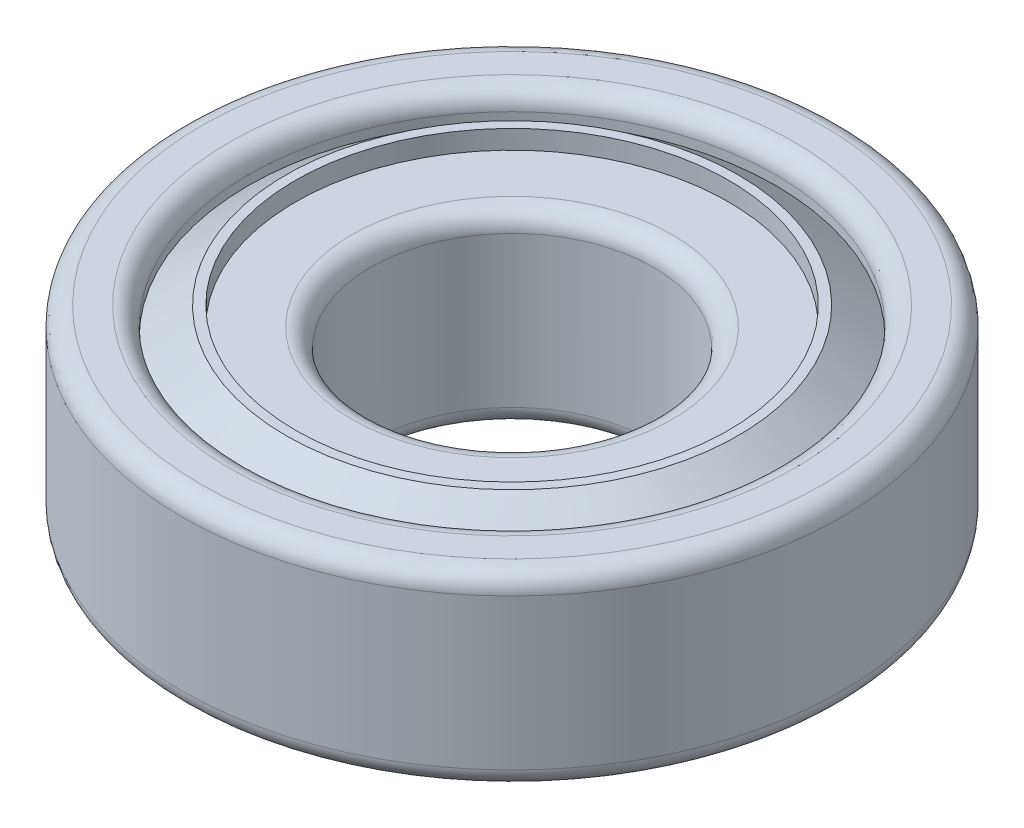
ISO-10303-21;
HEADER;
FILE_DESCRIPTION(('STEP AP214'),'2;1');
FILE_NAME('part.step','',(''),(''),'','','');
FILE_SCHEMA(('AUTOMOTIVE_DESIGN { 1 0 10303 214 1 1 1 1 }'));
ENDSEC;
DATA;
#1=APPLICATION_CONTEXT('core data for automotive mechanical design processes');
#2=APPLICATION_PROTOCOL_DEFINITION('international standard','automotive_design',2000,#1);
#3=PRODUCT_CONTEXT('',#1,'mechanical');
#4=PRODUCT('Part','Part','',(#3));
#5=PRODUCT_RELATED_PRODUCT_CATEGORY('part','',(#4));
#6=PRODUCT_DEFINITION_FORMATION('','',#4);
#7=PRODUCT_DEFINITION_CONTEXT('part definition',#1,'design');
#8=PRODUCT_DEFINITION('design','',#6,#7);
#9=PRODUCT_DEFINITION_SHAPE('','',#8);
#10=(LENGTH_UNIT() NAMED_UNIT(*) SI_UNIT(.MILLI.,.METRE.));
#11=(NAMED_UNIT(*) PLANE_ANGLE_UNIT() SI_UNIT($,.RADIAN.));
#12=(NAMED_UNIT(*) SI_UNIT($,.STERADIAN.) SOLID_ANGLE_UNIT());
#13=UNCERTAINTY_MEASURE_WITH_UNIT(LENGTH_MEASURE(1.E-05),#10,'distance_accuracy_value','');
#14=(GEOMETRIC_REPRESENTATION_CONTEXT(3) GLOBAL_UNCERTAINTY_ASSIGNED_CONTEXT((#13)) GLOBAL_UNIT_ASSIGNED_CONTEXT((#10,
#11,#12)) REPRESENTATION_CONTEXT('',''));
#15=CARTESIAN_POINT('',(0.,0.,0.));
#16=DIRECTION('',(0.,0.,1.));
#17=DIRECTION('',(1.,0.,0.));
#18=AXIS2_PLACEMENT_3D('',#15,#16,#17);
#19=CARTESIAN_POINT('',(0.,9.,0.));
#20=DIRECTION('',(0.,-1.,0.));
#21=DIRECTION('',(0.,0.,-1.));
#22=AXIS2_PLACEMENT_3D('',#19,#20,#21);
#23=PLANE('',#22);
#24=CARTESIAN_POINT('',(0.,9.,0.));
#25=DIRECTION('',(0.,-1.,0.));
#26=DIRECTION('',(0.,0.,-1.));
#27=AXIS2_PLACEMENT_3D('',#24,#25,#26);
#28=CIRCLE('',#27,8.5);
#29=CARTESIAN_POINT('',(0.,9.,-8.5));
#30=VERTEX_POINT('',#29);
#31=EDGE_CURVE('E10',#30,#30,#28,.T.);
#32=ORIENTED_EDGE('',*,*,#31,.T.);
#33=EDGE_LOOP('',(#32));
#34=FACE_BOUND('',#33,.T.);
#35=CARTESIAN_POINT('',(0.,9.,0.));
#36=DIRECTION('',(0.,1.,0.));
#37=DIRECTION('',(0.,0.,1.));
#38=AXIS2_PLACEMENT_3D('',#35,#36,#37);
#39=CIRCLE('',#38,11.5);
#40=CARTESIAN_POINT('',(0.,9.,11.5));
#41=VERTEX_POINT('',#40);
#42=EDGE_CURVE('E86',#41,#41,#39,.T.);
#43=ORIENTED_EDGE('',*,*,#42,.T.);
#44=EDGE_LOOP('',(#43));
#45=FACE_BOUND('',#44,.T.);
#46=ADVANCED_FACE('F33',(#34,#45),#23,.F.);
#47=CARTESIAN_POINT('',(0.,22.3329996144881,0.));
#48=DIRECTION('',(0.,1.,0.));
#49=DIRECTION('',(0.,0.,1.));
#50=AXIS2_PLACEMENT_3D('',#47,#48,#49);
#51=CYLINDRICAL_SURFACE('',#50,7.5);
#52=CARTESIAN_POINT('',(0.,0.,0.));
#53=DIRECTION('',(0.,1.,0.));
#54=DIRECTION('',(0.,0.,1.));
#55=AXIS2_PLACEMENT_3D('',#52,#53,#54);
#56=CIRCLE('',#55,7.5);
#57=CARTESIAN_POINT('',(0.,0.,7.5));
#58=VERTEX_POINT('',#57);
#59=EDGE_CURVE('E48',#58,#58,#56,.F.);
#60=ORIENTED_EDGE('',*,*,#59,.T.);
#61=EDGE_LOOP('',(#60));
#62=FACE_BOUND('',#61,.T.);
#63=CARTESIAN_POINT('',(0.,8.,0.));
#64=DIRECTION('',(0.,-1.,0.));
#65=DIRECTION('',(0.,0.,-1.));
#66=AXIS2_PLACEMENT_3D('',#63,#64,#65);
#67=CIRCLE('',#66,7.5);
#68=CARTESIAN_POINT('',(0.,8.,-7.5));
#69=VERTEX_POINT('',#68);
#70=EDGE_CURVE('E53',#69,#69,#67,.F.);
#71=ORIENTED_EDGE('',*,*,#70,.T.);
#72=EDGE_LOOP('',(#71));
#73=FACE_BOUND('',#72,.T.);
#74=ADVANCED_FACE('F113',(#62,#73),#51,.F.);
#75=CARTESIAN_POINT('',(0.,-1.,0.));
#76=DIRECTION('',(0.,1.,0.));
#77=DIRECTION('',(0.,0.,1.));
#78=AXIS2_PLACEMENT_3D('',#75,#76,#77);
#79=PLANE('',#78);
#80=CARTESIAN_POINT('',(0.,-1.,0.));
#81=DIRECTION('',(0.,1.,0.));
#82=DIRECTION('',(0.,0.,1.));
#83=AXIS2_PLACEMENT_3D('',#80,#81,#82);
#84=CIRCLE('',#83,8.5);
#85=CARTESIAN_POINT('',(0.,-1.,8.5));
#86=VERTEX_POINT('',#85);
#87=EDGE_CURVE('E56',#86,#86,#84,.T.);
#88=ORIENTED_EDGE('',*,*,#87,.T.);
#89=EDGE_LOOP('',(#88));
#90=FACE_BOUND('',#89,.T.);
#91=CARTESIAN_POINT('',(0.,-1.,0.));
#92=DIRECTION('',(0.,1.,0.));
#93=DIRECTION('',(0.,0.,1.));
#94=AXIS2_PLACEMENT_3D('',#91,#92,#93);
#95=CIRCLE('',#94,11.25);
#96=CARTESIAN_POINT('',(0.,-1.,11.25));
#97=VERTEX_POINT('',#96);
#98=EDGE_CURVE('E59',#97,#97,#95,.F.);
#99=ORIENTED_EDGE('',*,*,#98,.T.);
#100=EDGE_LOOP('',(#99));
#101=FACE_BOUND('',#100,.T.);
#102=ADVANCED_FACE('F118',(#90,#101),#79,.F.);
#103=CARTESIAN_POINT('',(0.,0.,0.));
#104=DIRECTION('',(0.,1.,0.));
#105=DIRECTION('',(0.,0.,1.));
#106=AXIS2_PLACEMENT_3D('',#103,#104,#105);
#107=PLANE('',#106);
#108=CARTESIAN_POINT('',(0.,0.,0.));
#109=DIRECTION('',(0.,1.,0.));
#110=DIRECTION('',(0.,0.,1.));
#111=AXIS2_PLACEMENT_3D('',#108,#109,#110);
#112=CIRCLE('',#111,16.5);
#113=CARTESIAN_POINT('',(0.,0.,16.5));
#114=VERTEX_POINT('',#113);
#115=EDGE_CURVE('E65',#114,#114,#112,.F.);
#116=ORIENTED_EDGE('',*,*,#115,.T.);
#117=EDGE_LOOP('',(#116));
#118=FACE_BOUND('',#117,.T.);
#119=CARTESIAN_POINT('',(0.,0.,0.));
#120=DIRECTION('',(0.,1.,0.));
#121=DIRECTION('',(0.,0.,1.));
#122=AXIS2_PLACEMENT_3D('',#119,#120,#121);
#123=CIRCLE('',#122,12.25);
#124=CARTESIAN_POINT('',(0.,0.,12.25));
#125=VERTEX_POINT('',#124);
#126=EDGE_CURVE('E74',#125,#125,#123,.T.);
#127=ORIENTED_EDGE('',*,*,#126,.T.);
#128=EDGE_LOOP('',(#127));
#129=FACE_BOUND('',#128,.T.);
#130=ADVANCED_FACE('F157',(#118,#129),#107,.F.);
#131=CARTESIAN_POINT('',(0.,22.3329996144881,0.));
#132=DIRECTION('',(0.,1.,0.));
#133=DIRECTION('',(0.,0.,1.));
#134=AXIS2_PLACEMENT_3D('',#131,#132,#133);
#135=CYLINDRICAL_SURFACE('',#134,17.5);
#136=CARTESIAN_POINT('',(0.,1.,0.));
#137=DIRECTION('',(0.,1.,0.));
#138=DIRECTION('',(0.,0.,1.));
#139=AXIS2_PLACEMENT_3D('',#136,#137,#138);
#140=CIRCLE('',#139,17.5);
#141=CARTESIAN_POINT('',(0.,1.,17.5));
#142=VERTEX_POINT('',#141);
#143=EDGE_CURVE('E68',#142,#142,#140,.T.);
#144=ORIENTED_EDGE('',*,*,#143,.T.);
#145=EDGE_LOOP('',(#144));
#146=FACE_BOUND('',#145,.T.);
#147=CARTESIAN_POINT('',(0.,9.,0.));
#148=DIRECTION('',(0.,1.,0.));
#149=DIRECTION('',(0.,0.,1.));
#150=AXIS2_PLACEMENT_3D('',#147,#148,#149);
#151=CIRCLE('',#150,17.5);
#152=CARTESIAN_POINT('',(0.,9.,17.5));
#153=VERTEX_POINT('',#152);
#154=EDGE_CURVE('E71',#153,#153,#151,.F.);
#155=ORIENTED_EDGE('',*,*,#154,.T.);
#156=EDGE_LOOP('',(#155));
#157=FACE_BOUND('',#156,.T.);
#158=ADVANCED_FACE('F111',(#146,#157),#135,.T.);
#159=CARTESIAN_POINT('',(0.,10.,0.));
#160=DIRECTION('',(0.,1.,0.));
#161=DIRECTION('',(0.,0.,1.));
#162=AXIS2_PLACEMENT_3D('',#159,#160,#161);
#163=PLANE('',#162);
#164=CARTESIAN_POINT('',(0.,10.,0.));
#165=DIRECTION('',(0.,1.,0.));
#166=DIRECTION('',(0.,0.,1.));
#167=AXIS2_PLACEMENT_3D('',#164,#165,#166);
#168=CIRCLE('',#167,15.);
#169=CARTESIAN_POINT('',(0.,10.,15.));
#170=VERTEX_POINT('',#169);
#171=EDGE_CURVE('E40',#170,#170,#168,.F.);
#172=ORIENTED_EDGE('',*,*,#171,.T.);
#173=EDGE_LOOP('',(#172));
#174=FACE_BOUND('',#173,.T.);
#175=CARTESIAN_POINT('',(0.,10.,0.));
#176=DIRECTION('',(0.,1.,0.));
#177=DIRECTION('',(0.,0.,1.));
#178=AXIS2_PLACEMENT_3D('',#175,#176,#177);
#179=CIRCLE('',#178,16.5);
#180=CARTESIAN_POINT('',(0.,10.,16.5));
#181=VERTEX_POINT('',#180);
#182=EDGE_CURVE('E62',#181,#181,#179,.T.);
#183=ORIENTED_EDGE('',*,*,#182,.T.);
#184=EDGE_LOOP('',(#183));
#185=FACE_BOUND('',#184,.T.);
#186=ADVANCED_FACE('F103',(#174,#185),#163,.T.);
#187=CARTESIAN_POINT('',(0.,22.3329996144881,0.));
#188=DIRECTION('',(0.,1.,0.));
#189=DIRECTION('',(0.,0.,1.));
#190=AXIS2_PLACEMENT_3D('',#187,#188,#189);
#191=CYLINDRICAL_SURFACE('',#190,14.);
#192=CARTESIAN_POINT('',(0.,9.,0.));
#193=DIRECTION('',(0.,1.,0.));
#194=DIRECTION('',(0.,0.,1.));
#195=AXIS2_PLACEMENT_3D('',#192,#193,#194);
#196=CIRCLE('',#195,14.);
#197=CARTESIAN_POINT('',(0.,9.,14.));
#198=VERTEX_POINT('',#197);
#199=EDGE_CURVE('E44',#198,#198,#196,.T.);
#200=ORIENTED_EDGE('',*,*,#199,.T.);
#201=EDGE_LOOP('',(#200));
#202=FACE_BOUND('',#201,.T.);
#203=CARTESIAN_POINT('',(0.,8.50467296178466,0.));
#204=DIRECTION('',(0.,1.,0.));
#205=DIRECTION('',(0.,0.,1.));
#206=AXIS2_PLACEMENT_3D('',#203,#204,#205);
#207=CIRCLE('',#206,14.);
#208=CARTESIAN_POINT('',(0.,8.50467296178466,14.));
#209=VERTEX_POINT('',#208);
#210=EDGE_CURVE('E77',#209,#209,#207,.T.);
#211=ORIENTED_EDGE('',*,*,#210,.F.);
#212=EDGE_LOOP('',(#211));
#213=FACE_BOUND('',#212,.T.);
#214=ADVANCED_FACE('F107',(#202,#213),#191,.F.);
#215=CARTESIAN_POINT('',(0.,8.50467296178466,0.));
#216=DIRECTION('',(0.,-1.,0.));
#217=DIRECTION('',(0.,0.,-1.));
#218=AXIS2_PLACEMENT_3D('',#215,#216,#217);
#219=CONICAL_SURFACE('',#218,14.,0.928792243586038);
#220=CARTESIAN_POINT('',(0.,10.,0.));
#221=DIRECTION('',(0.,1.,0.));
#222=DIRECTION('',(0.,0.,1.));
#223=AXIS2_PLACEMENT_3D('',#220,#221,#222);
#224=CIRCLE('',#223,12.);
#225=CARTESIAN_POINT('',(0.,10.,12.));
#226=VERTEX_POINT('',#225);
#227=EDGE_CURVE('E80',#226,#226,#224,.T.);
#228=ORIENTED_EDGE('',*,*,#227,.F.);
#229=EDGE_LOOP('',(#228));
#230=FACE_BOUND('',#229,.T.);
#231=ORIENTED_EDGE('',*,*,#210,.T.);
#232=EDGE_LOOP('',(#231));
#233=FACE_BOUND('',#232,.T.);
#234=ADVANCED_FACE('F100',(#230,#233),#219,.T.);
#235=ORIENTED_EDGE('',*,*,#227,.T.);
#236=EDGE_LOOP('',(#235));
#237=FACE_BOUND('',#236,.T.);
#238=CARTESIAN_POINT('',(0.,10.,0.));
#239=DIRECTION('',(0.,1.,0.));
#240=DIRECTION('',(0.,0.,1.));
#241=AXIS2_PLACEMENT_3D('',#238,#239,#240);
#242=CIRCLE('',#241,11.5);
#243=CARTESIAN_POINT('',(0.,10.,11.5));
#244=VERTEX_POINT('',#243);
#245=EDGE_CURVE('E83',#244,#244,#242,.T.);
#246=ORIENTED_EDGE('',*,*,#245,.F.);
#247=EDGE_LOOP('',(#246));
#248=FACE_BOUND('',#247,.T.);
#249=ADVANCED_FACE('F95',(#237,#248),#163,.T.);
#250=CARTESIAN_POINT('',(0.,22.3329996144881,0.));
#251=DIRECTION('',(0.,1.,0.));
#252=DIRECTION('',(0.,0.,1.));
#253=AXIS2_PLACEMENT_3D('',#250,#251,#252);
#254=CYLINDRICAL_SURFACE('',#253,11.5);
#255=ORIENTED_EDGE('',*,*,#42,.F.);
#256=EDGE_LOOP('',(#255));
#257=FACE_BOUND('',#256,.T.);
#258=ORIENTED_EDGE('',*,*,#245,.T.);
#259=EDGE_LOOP('',(#258));
#260=FACE_BOUND('',#259,.T.);
#261=ADVANCED_FACE('F91',(#257,#260),#254,.F.);
#262=CARTESIAN_POINT('',(0.,1.,0.));
#263=DIRECTION('',(0.,1.,0.));
#264=DIRECTION('',(0.,0.,1.));
#265=AXIS2_PLACEMENT_3D('',#262,#263,#264);
#266=TOROIDAL_SURFACE('',#265,16.5,1.);
#267=ORIENTED_EDGE('',*,*,#115,.F.);
#268=EDGE_LOOP('',(#267));
#269=FACE_BOUND('',#268,.T.);
#270=ORIENTED_EDGE('',*,*,#143,.F.);
#271=EDGE_LOOP('',(#270));
#272=FACE_BOUND('',#271,.T.);
#273=ADVANCED_FACE('F94',(#269,#272),#266,.T.);
#274=CARTESIAN_POINT('',(0.,9.,0.));
#275=DIRECTION('',(0.,1.,0.));
#276=DIRECTION('',(0.,0.,1.));
#277=AXIS2_PLACEMENT_3D('',#274,#275,#276);
#278=TOROIDAL_SURFACE('',#277,16.5,1.);
#279=ORIENTED_EDGE('',*,*,#154,.F.);
#280=EDGE_LOOP('',(#279));
#281=FACE_BOUND('',#280,.T.);
#282=ORIENTED_EDGE('',*,*,#182,.F.);
#283=EDGE_LOOP('',(#282));
#284=FACE_BOUND('',#283,.T.);
#285=ADVANCED_FACE('F125',(#281,#284),#278,.T.);
#286=CARTESIAN_POINT('',(0.,0.,0.));
#287=DIRECTION('',(0.,1.,0.));
#288=DIRECTION('',(0.,0.,1.));
#289=AXIS2_PLACEMENT_3D('',#286,#287,#288);
#290=TOROIDAL_SURFACE('',#289,8.5,1.);
#291=ORIENTED_EDGE('',*,*,#59,.F.);
#292=EDGE_LOOP('',(#291));
#293=FACE_BOUND('',#292,.T.);
#294=ORIENTED_EDGE('',*,*,#87,.F.);
#295=EDGE_LOOP('',(#294));
#296=FACE_BOUND('',#295,.T.);
#297=ADVANCED_FACE('F129',(#293,#296),#290,.T.);
#298=CARTESIAN_POINT('',(0.,0.,0.));
#299=DIRECTION('',(0.,1.,0.));
#300=DIRECTION('',(0.,0.,1.));
#301=AXIS2_PLACEMENT_3D('',#298,#299,#300);
#302=TOROIDAL_SURFACE('',#301,11.25,1.);
#303=ORIENTED_EDGE('',*,*,#98,.F.);
#304=EDGE_LOOP('',(#303));
#305=FACE_BOUND('',#304,.T.);
#306=ORIENTED_EDGE('',*,*,#126,.F.);
#307=EDGE_LOOP('',(#306));
#308=FACE_BOUND('',#307,.T.);
#309=ADVANCED_FACE('F133',(#305,#308),#302,.T.);
#310=CARTESIAN_POINT('',(0.,9.,0.));
#311=DIRECTION('',(0.,1.,0.));
#312=DIRECTION('',(0.,0.,1.));
#313=AXIS2_PLACEMENT_3D('',#310,#311,#312);
#314=TOROIDAL_SURFACE('',#313,15.,1.);
#315=ORIENTED_EDGE('',*,*,#171,.F.);
#316=EDGE_LOOP('',(#315));
#317=FACE_BOUND('',#316,.T.);
#318=ORIENTED_EDGE('',*,*,#199,.F.);
#319=EDGE_LOOP('',(#318));
#320=FACE_BOUND('',#319,.T.);
#321=ADVANCED_FACE('F136',(#317,#320),#314,.T.);
#322=CARTESIAN_POINT('',(0.,8.,0.));
#323=DIRECTION('',(0.,-1.,0.));
#324=DIRECTION('',(0.,0.,-1.));
#325=AXIS2_PLACEMENT_3D('',#322,#323,#324);
#326=TOROIDAL_SURFACE('',#325,8.5,1.);
#327=ORIENTED_EDGE('',*,*,#31,.F.);
#328=EDGE_LOOP('',(#327));
#329=FACE_BOUND('',#328,.T.);
#330=ORIENTED_EDGE('',*,*,#70,.F.);
#331=EDGE_LOOP('',(#330));
#332=FACE_BOUND('',#331,.T.);
#333=ADVANCED_FACE('F35',(#329,#332),#326,.T.);
#334=CLOSED_SHELL('',(#46,#74,#102,#130,#158,#186,#214,#234,#249,#261,#273,#285,#297,#309,#321,#333));
#335=MANIFOLD_SOLID_BREP('B2',#334);
#336=ADVANCED_BREP_SHAPE_REPRESENTATION('',(#18,#335),#14);
#337=SHAPE_DEFINITION_REPRESENTATION(#9,#336);
ENDSEC;
END-ISO-10303-21;
